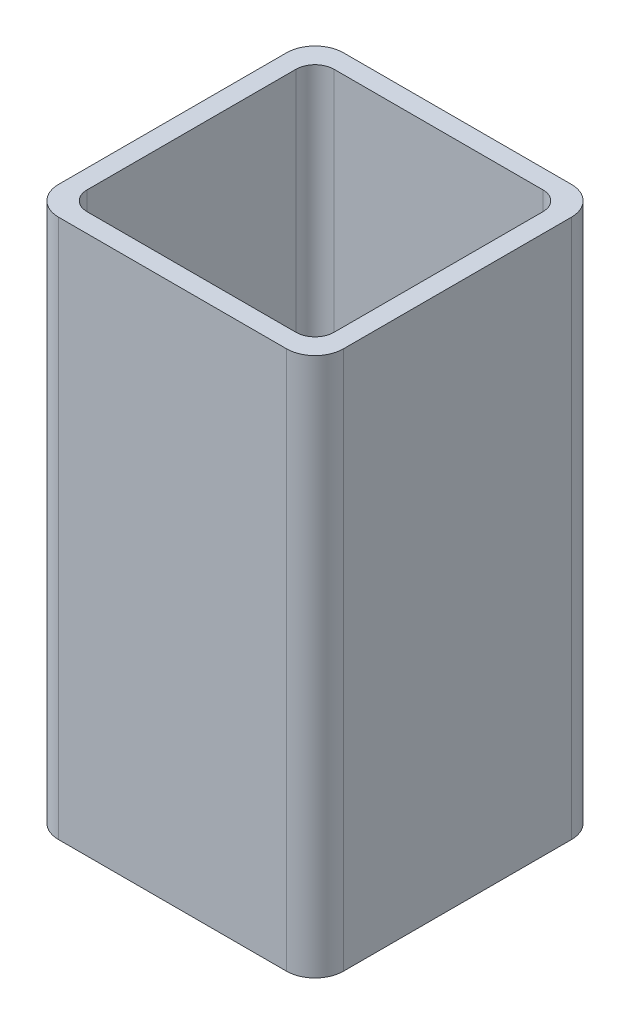
ISO-10303-21;
HEADER;
FILE_DESCRIPTION(('STEP AP214'),'2;1');
FILE_NAME('part.step','',(''),(''),'','','');
FILE_SCHEMA(('AUTOMOTIVE_DESIGN { 1 0 10303 214 1 1 1 1 }'));
ENDSEC;
DATA;
#1=APPLICATION_CONTEXT('core data for automotive mechanical design processes');
#2=APPLICATION_PROTOCOL_DEFINITION('international standard','automotive_design',2000,#1);
#3=PRODUCT_CONTEXT('',#1,'mechanical');
#4=PRODUCT('Part','Part','',(#3));
#5=PRODUCT_RELATED_PRODUCT_CATEGORY('part','',(#4));
#6=PRODUCT_DEFINITION_FORMATION('','',#4);
#7=PRODUCT_DEFINITION_CONTEXT('part definition',#1,'design');
#8=PRODUCT_DEFINITION('design','',#6,#7);
#9=PRODUCT_DEFINITION_SHAPE('','',#8);
#10=(LENGTH_UNIT() NAMED_UNIT(*) SI_UNIT(.MILLI.,.METRE.));
#11=(NAMED_UNIT(*) PLANE_ANGLE_UNIT() SI_UNIT($,.RADIAN.));
#12=(NAMED_UNIT(*) SI_UNIT($,.STERADIAN.) SOLID_ANGLE_UNIT());
#13=UNCERTAINTY_MEASURE_WITH_UNIT(LENGTH_MEASURE(1.E-05),#10,'distance_accuracy_value','');
#14=(GEOMETRIC_REPRESENTATION_CONTEXT(3) GLOBAL_UNCERTAINTY_ASSIGNED_CONTEXT((#13)) GLOBAL_UNIT_ASSIGNED_CONTEXT((#10,
#11,#12)) REPRESENTATION_CONTEXT('',''));
#15=CARTESIAN_POINT('',(0.,0.,0.));
#16=DIRECTION('',(0.,0.,1.));
#17=DIRECTION('',(1.,0.,0.));
#18=AXIS2_PLACEMENT_3D('',#15,#16,#17);
#19=CARTESIAN_POINT('',(-27.,-99.2002175516719,12.));
#20=DIRECTION('',(0.,1.,0.));
#21=DIRECTION('',(0.,0.,1.));
#22=AXIS2_PLACEMENT_3D('',#19,#20,#21);
#23=CYLINDRICAL_SURFACE('',#22,3.);
#24=DIRECTION('',(0.,1.,0.));
#25=VECTOR('',#24,1.);
#26=CARTESIAN_POINT('',(-30.,-99.2002175516719,12.));
#27=LINE('',#26,#25);
#28=CARTESIAN_POINT('',(-30.,-56.773810680479,12.));
#29=VERTEX_POINT('',#28);
#30=CARTESIAN_POINT('',(-30.,0.,12.));
#31=VERTEX_POINT('',#30);
#32=EDGE_CURVE('E189',#29,#31,#27,.T.);
#33=ORIENTED_EDGE('',*,*,#32,.F.);
#34=CARTESIAN_POINT('',(-27.,-56.773810680479,12.));
#35=DIRECTION('',(0.,-1.,0.));
#36=DIRECTION('',(0.,0.,-1.));
#37=AXIS2_PLACEMENT_3D('',#34,#35,#36);
#38=CIRCLE('',#37,3.);
#39=CARTESIAN_POINT('',(-27.,-56.773810680479,15.));
#40=VERTEX_POINT('',#39);
#41=EDGE_CURVE('E183',#29,#40,#38,.F.);
#42=ORIENTED_EDGE('',*,*,#41,.T.);
#43=DIRECTION('',(0.,1.,0.));
#44=VECTOR('',#43,1.);
#45=CARTESIAN_POINT('',(-27.,-99.2002175516719,15.));
#46=LINE('',#45,#44);
#47=CARTESIAN_POINT('',(-27.,0.,15.));
#48=VERTEX_POINT('',#47);
#49=EDGE_CURVE('E185',#40,#48,#46,.T.);
#50=ORIENTED_EDGE('',*,*,#49,.T.);
#51=CARTESIAN_POINT('',(-27.,0.,12.));
#52=DIRECTION('',(0.,1.,0.));
#53=DIRECTION('',(0.,0.,1.));
#54=AXIS2_PLACEMENT_3D('',#51,#52,#53);
#55=CIRCLE('',#54,3.);
#56=EDGE_CURVE('E247',#31,#48,#55,.T.);
#57=ORIENTED_EDGE('',*,*,#56,.F.);
#58=EDGE_LOOP('',(#33,#42,#50,#57));
#59=FACE_BOUND('',#58,.T.);
#60=ADVANCED_FACE('F35',(#59),#23,.T.);
#61=CARTESIAN_POINT('',(-30.,-99.2002175516719,-12.));
#62=DIRECTION('',(-1.,0.,0.));
#63=DIRECTION('',(0.,0.,1.));
#64=AXIS2_PLACEMENT_3D('',#61,#62,#63);
#65=PLANE('',#64);
#66=DIRECTION('',(0.,1.,0.));
#67=VECTOR('',#66,1.);
#68=CARTESIAN_POINT('',(-30.,-99.2002175516719,-12.));
#69=LINE('',#68,#67);
#70=CARTESIAN_POINT('',(-30.,-56.773810680479,-12.));
#71=VERTEX_POINT('',#70);
#72=CARTESIAN_POINT('',(-30.,0.,-12.));
#73=VERTEX_POINT('',#72);
#74=EDGE_CURVE('E193',#71,#73,#69,.T.);
#75=ORIENTED_EDGE('',*,*,#74,.F.);
#76=DIRECTION('',(0.,0.,1.));
#77=VECTOR('',#76,1.);
#78=CARTESIAN_POINT('',(-30.,-56.773810680479,-12.));
#79=LINE('',#78,#77);
#80=EDGE_CURVE('E186',#71,#29,#79,.T.);
#81=ORIENTED_EDGE('',*,*,#80,.T.);
#82=ORIENTED_EDGE('',*,*,#32,.T.);
#83=DIRECTION('',(0.,0.,1.));
#84=VECTOR('',#83,1.);
#85=CARTESIAN_POINT('',(-30.,0.,-12.));
#86=LINE('',#85,#84);
#87=EDGE_CURVE('E169',#73,#31,#86,.T.);
#88=ORIENTED_EDGE('',*,*,#87,.F.);
#89=EDGE_LOOP('',(#75,#81,#82,#88));
#90=FACE_BOUND('',#89,.T.);
#91=ADVANCED_FACE('F291',(#90),#65,.T.);
#92=CARTESIAN_POINT('',(-27.,-99.2002175516719,-12.));
#93=DIRECTION('',(0.,1.,0.));
#94=DIRECTION('',(0.,0.,1.));
#95=AXIS2_PLACEMENT_3D('',#92,#93,#94);
#96=CYLINDRICAL_SURFACE('',#95,3.);
#97=DIRECTION('',(0.,1.,0.));
#98=VECTOR('',#97,1.);
#99=CARTESIAN_POINT('',(-27.,-99.2002175516719,-15.));
#100=LINE('',#99,#98);
#101=CARTESIAN_POINT('',(-27.,-56.773810680479,-15.));
#102=VERTEX_POINT('',#101);
#103=CARTESIAN_POINT('',(-27.,0.,-15.));
#104=VERTEX_POINT('',#103);
#105=EDGE_CURVE('E197',#102,#104,#100,.T.);
#106=ORIENTED_EDGE('',*,*,#105,.F.);
#107=CARTESIAN_POINT('',(-27.,-56.773810680479,-12.));
#108=DIRECTION('',(0.,-1.,0.));
#109=DIRECTION('',(0.,0.,-1.));
#110=AXIS2_PLACEMENT_3D('',#107,#108,#109);
#111=CIRCLE('',#110,3.);
#112=EDGE_CURVE('E190',#102,#71,#111,.F.);
#113=ORIENTED_EDGE('',*,*,#112,.T.);
#114=ORIENTED_EDGE('',*,*,#74,.T.);
#115=CARTESIAN_POINT('',(-27.,0.,-12.));
#116=DIRECTION('',(0.,1.,0.));
#117=DIRECTION('',(0.,0.,1.));
#118=AXIS2_PLACEMENT_3D('',#115,#116,#117);
#119=CIRCLE('',#118,3.);
#120=EDGE_CURVE('E338',#104,#73,#119,.T.);
#121=ORIENTED_EDGE('',*,*,#120,.F.);
#122=EDGE_LOOP('',(#106,#113,#114,#121));
#123=FACE_BOUND('',#122,.T.);
#124=ADVANCED_FACE('F297',(#123),#96,.T.);
#125=CARTESIAN_POINT('',(-27.,-99.2002175516719,-15.));
#126=DIRECTION('',(0.,0.,-1.));
#127=DIRECTION('',(-1.,0.,0.));
#128=AXIS2_PLACEMENT_3D('',#125,#126,#127);
#129=PLANE('',#128);
#130=DIRECTION('',(0.,1.,0.));
#131=VECTOR('',#130,1.);
#132=CARTESIAN_POINT('',(-3.00000000000004,-99.2002175516719,-15.));
#133=LINE('',#132,#131);
#134=CARTESIAN_POINT('',(-3.00000000000004,-56.773810680479,-15.));
#135=VERTEX_POINT('',#134);
#136=CARTESIAN_POINT('',(-3.00000000000004,0.,-15.));
#137=VERTEX_POINT('',#136);
#138=EDGE_CURVE('E201',#135,#137,#133,.T.);
#139=ORIENTED_EDGE('',*,*,#138,.F.);
#140=DIRECTION('',(-1.,0.,0.));
#141=VECTOR('',#140,1.);
#142=CARTESIAN_POINT('',(-27.,-56.773810680479,-15.));
#143=LINE('',#142,#141);
#144=EDGE_CURVE('E194',#135,#102,#143,.T.);
#145=ORIENTED_EDGE('',*,*,#144,.T.);
#146=ORIENTED_EDGE('',*,*,#105,.T.);
#147=DIRECTION('',(-1.,0.,0.));
#148=VECTOR('',#147,1.);
#149=CARTESIAN_POINT('',(-27.,0.,-15.));
#150=LINE('',#149,#148);
#151=EDGE_CURVE('E346',#137,#104,#150,.T.);
#152=ORIENTED_EDGE('',*,*,#151,.F.);
#153=EDGE_LOOP('',(#139,#145,#146,#152));
#154=FACE_BOUND('',#153,.T.);
#155=ADVANCED_FACE('F327',(#154),#129,.T.);
#156=CARTESIAN_POINT('',(-3.00000000000004,-99.2002175516719,-12.));
#157=DIRECTION('',(0.,1.,0.));
#158=DIRECTION('',(0.,0.,1.));
#159=AXIS2_PLACEMENT_3D('',#156,#157,#158);
#160=CYLINDRICAL_SURFACE('',#159,3.);
#161=DIRECTION('',(0.,1.,0.));
#162=VECTOR('',#161,1.);
#163=CARTESIAN_POINT('',(0.,-99.2002175516719,-12.));
#164=LINE('',#163,#162);
#165=CARTESIAN_POINT('',(0.,-56.773810680479,-12.));
#166=VERTEX_POINT('',#165);
#167=CARTESIAN_POINT('',(0.,0.,-12.));
#168=VERTEX_POINT('',#167);
#169=EDGE_CURVE('E205',#166,#168,#164,.T.);
#170=ORIENTED_EDGE('',*,*,#169,.F.);
#171=CARTESIAN_POINT('',(-3.00000000000004,-56.773810680479,-12.));
#172=DIRECTION('',(0.,-1.,0.));
#173=DIRECTION('',(0.,0.,-1.));
#174=AXIS2_PLACEMENT_3D('',#171,#172,#173);
#175=CIRCLE('',#174,3.);
#176=EDGE_CURVE('E198',#166,#135,#175,.F.);
#177=ORIENTED_EDGE('',*,*,#176,.T.);
#178=ORIENTED_EDGE('',*,*,#138,.T.);
#179=CARTESIAN_POINT('',(-3.00000000000004,0.,-12.));
#180=DIRECTION('',(0.,1.,0.));
#181=DIRECTION('',(0.,0.,-1.));
#182=AXIS2_PLACEMENT_3D('',#179,#180,#181);
#183=CIRCLE('',#182,3.);
#184=EDGE_CURVE('E349',#168,#137,#183,.T.);
#185=ORIENTED_EDGE('',*,*,#184,.F.);
#186=EDGE_LOOP('',(#170,#177,#178,#185));
#187=FACE_BOUND('',#186,.T.);
#188=ADVANCED_FACE('F323',(#187),#160,.T.);
#189=CARTESIAN_POINT('',(0.,-99.2002175516719,-12.));
#190=DIRECTION('',(1.,0.,0.));
#191=DIRECTION('',(0.,0.,-1.));
#192=AXIS2_PLACEMENT_3D('',#189,#190,#191);
#193=PLANE('',#192);
#194=DIRECTION('',(0.,1.,0.));
#195=VECTOR('',#194,1.);
#196=CARTESIAN_POINT('',(0.,-99.2002175516719,12.));
#197=LINE('',#196,#195);
#198=CARTESIAN_POINT('',(0.,-56.773810680479,12.));
#199=VERTEX_POINT('',#198);
#200=CARTESIAN_POINT('',(0.,0.,12.));
#201=VERTEX_POINT('',#200);
#202=EDGE_CURVE('E208',#199,#201,#197,.T.);
#203=ORIENTED_EDGE('',*,*,#202,.F.);
#204=DIRECTION('',(0.,0.,-1.));
#205=VECTOR('',#204,1.);
#206=CARTESIAN_POINT('',(0.,-56.773810680479,-12.));
#207=LINE('',#206,#205);
#208=EDGE_CURVE('E202',#199,#166,#207,.T.);
#209=ORIENTED_EDGE('',*,*,#208,.T.);
#210=ORIENTED_EDGE('',*,*,#169,.T.);
#211=DIRECTION('',(0.,0.,-1.));
#212=VECTOR('',#211,1.);
#213=CARTESIAN_POINT('',(0.,0.,-12.));
#214=LINE('',#213,#212);
#215=EDGE_CURVE('E353',#201,#168,#214,.T.);
#216=ORIENTED_EDGE('',*,*,#215,.F.);
#217=EDGE_LOOP('',(#203,#209,#210,#216));
#218=FACE_BOUND('',#217,.T.);
#219=ADVANCED_FACE('F319',(#218),#193,.T.);
#220=CARTESIAN_POINT('',(-3.00000000000003,-99.2002175516719,12.));
#221=DIRECTION('',(0.,1.,0.));
#222=DIRECTION('',(0.,0.,1.));
#223=AXIS2_PLACEMENT_3D('',#220,#221,#222);
#224=CYLINDRICAL_SURFACE('',#223,3.);
#225=DIRECTION('',(0.,1.,0.));
#226=VECTOR('',#225,1.);
#227=CARTESIAN_POINT('',(-3.00000000000003,-99.2002175516719,15.));
#228=LINE('',#227,#226);
#229=CARTESIAN_POINT('',(-3.00000000000003,-56.7738106804791,15.));
#230=VERTEX_POINT('',#229);
#231=CARTESIAN_POINT('',(-3.00000000000003,0.,15.));
#232=VERTEX_POINT('',#231);
#233=EDGE_CURVE('E216',#230,#232,#228,.T.);
#234=ORIENTED_EDGE('',*,*,#233,.F.);
#235=CARTESIAN_POINT('',(-3.00000000000003,-56.773810680479,12.));
#236=DIRECTION('',(0.,-1.,0.));
#237=DIRECTION('',(0.,0.,-1.));
#238=AXIS2_PLACEMENT_3D('',#235,#236,#237);
#239=CIRCLE('',#238,3.);
#240=EDGE_CURVE('E206',#230,#199,#239,.F.);
#241=ORIENTED_EDGE('',*,*,#240,.T.);
#242=ORIENTED_EDGE('',*,*,#202,.T.);
#243=CARTESIAN_POINT('',(-3.00000000000003,0.,12.));
#244=DIRECTION('',(0.,1.,0.));
#245=DIRECTION('',(0.,0.,1.));
#246=AXIS2_PLACEMENT_3D('',#243,#244,#245);
#247=CIRCLE('',#246,3.);
#248=EDGE_CURVE('E256',#232,#201,#247,.T.);
#249=ORIENTED_EDGE('',*,*,#248,.F.);
#250=EDGE_LOOP('',(#234,#241,#242,#249));
#251=FACE_BOUND('',#250,.T.);
#252=ADVANCED_FACE('F315',(#251),#224,.T.);
#253=CARTESIAN_POINT('',(-27.,-99.2002175516719,15.));
#254=DIRECTION('',(0.,0.,1.));
#255=DIRECTION('',(1.,0.,0.));
#256=AXIS2_PLACEMENT_3D('',#253,#254,#255);
#257=PLANE('',#256);
#258=ORIENTED_EDGE('',*,*,#49,.F.);
#259=DIRECTION('',(1.,0.,0.));
#260=VECTOR('',#259,1.);
#261=CARTESIAN_POINT('',(-27.,-56.773810680479,15.));
#262=LINE('',#261,#260);
#263=EDGE_CURVE('E53',#40,#230,#262,.T.);
#264=ORIENTED_EDGE('',*,*,#263,.T.);
#265=ORIENTED_EDGE('',*,*,#233,.T.);
#266=DIRECTION('',(1.,0.,0.));
#267=VECTOR('',#266,1.);
#268=CARTESIAN_POINT('',(-27.,0.,15.));
#269=LINE('',#268,#267);
#270=EDGE_CURVE('E250',#48,#232,#269,.T.);
#271=ORIENTED_EDGE('',*,*,#270,.F.);
#272=EDGE_LOOP('',(#258,#264,#265,#271));
#273=FACE_BOUND('',#272,.T.);
#274=ADVANCED_FACE('F312',(#273),#257,.T.);
#275=CARTESIAN_POINT('',(-26.,-99.2002175516719,11.));
#276=DIRECTION('',(0.,1.,0.));
#277=DIRECTION('',(0.,0.,1.));
#278=AXIS2_PLACEMENT_3D('',#275,#276,#277);
#279=CYLINDRICAL_SURFACE('',#278,2.);
#280=CARTESIAN_POINT('',(-26.,-56.773810680479,11.));
#281=DIRECTION('',(0.,-1.,0.));
#282=DIRECTION('',(0.,0.,-1.));
#283=AXIS2_PLACEMENT_3D('',#280,#281,#282);
#284=CIRCLE('',#283,2.);
#285=CARTESIAN_POINT('',(-28.,-56.7738106804791,11.));
#286=VERTEX_POINT('',#285);
#287=CARTESIAN_POINT('',(-26.,-56.7738106804791,13.));
#288=VERTEX_POINT('',#287);
#289=EDGE_CURVE('E147',#286,#288,#284,.F.);
#290=ORIENTED_EDGE('',*,*,#289,.F.);
#291=DIRECTION('',(0.,1.,0.));
#292=VECTOR('',#291,1.);
#293=CARTESIAN_POINT('',(-28.,-99.2002175516719,11.));
#294=LINE('',#293,#292);
#295=CARTESIAN_POINT('',(-28.,0.,11.));
#296=VERTEX_POINT('',#295);
#297=EDGE_CURVE('E218',#286,#296,#294,.T.);
#298=ORIENTED_EDGE('',*,*,#297,.T.);
#299=CARTESIAN_POINT('',(-26.,0.,11.));
#300=DIRECTION('',(0.,1.,0.));
#301=DIRECTION('',(0.,0.,1.));
#302=AXIS2_PLACEMENT_3D('',#299,#300,#301);
#303=CIRCLE('',#302,2.);
#304=CARTESIAN_POINT('',(-26.,0.,13.));
#305=VERTEX_POINT('',#304);
#306=EDGE_CURVE('E150',#296,#305,#303,.T.);
#307=ORIENTED_EDGE('',*,*,#306,.T.);
#308=DIRECTION('',(0.,1.,0.));
#309=VECTOR('',#308,1.);
#310=CARTESIAN_POINT('',(-26.,-99.2002175516719,13.));
#311=LINE('',#310,#309);
#312=EDGE_CURVE('E39',#288,#305,#311,.T.);
#313=ORIENTED_EDGE('',*,*,#312,.F.);
#314=EDGE_LOOP('',(#290,#298,#307,#313));
#315=FACE_BOUND('',#314,.T.);
#316=ADVANCED_FACE('F145',(#315),#279,.F.);
#317=CARTESIAN_POINT('',(-28.,-99.2002175516719,-11.));
#318=DIRECTION('',(-1.,0.,0.));
#319=DIRECTION('',(0.,0.,1.));
#320=AXIS2_PLACEMENT_3D('',#317,#318,#319);
#321=PLANE('',#320);
#322=DIRECTION('',(0.,0.,1.));
#323=VECTOR('',#322,1.);
#324=CARTESIAN_POINT('',(-28.,-56.773810680479,-11.));
#325=LINE('',#324,#323);
#326=CARTESIAN_POINT('',(-28.,-56.7738106804791,-11.));
#327=VERTEX_POINT('',#326);
#328=EDGE_CURVE('E167',#327,#286,#325,.T.);
#329=ORIENTED_EDGE('',*,*,#328,.F.);
#330=DIRECTION('',(0.,1.,0.));
#331=VECTOR('',#330,1.);
#332=CARTESIAN_POINT('',(-28.,-99.2002175516719,-11.));
#333=LINE('',#332,#331);
#334=CARTESIAN_POINT('',(-28.,0.,-11.));
#335=VERTEX_POINT('',#334);
#336=EDGE_CURVE('E221',#327,#335,#333,.T.);
#337=ORIENTED_EDGE('',*,*,#336,.T.);
#338=DIRECTION('',(0.,0.,1.));
#339=VECTOR('',#338,1.);
#340=CARTESIAN_POINT('',(-28.,0.,-11.));
#341=LINE('',#340,#339);
#342=EDGE_CURVE('E223',#335,#296,#341,.T.);
#343=ORIENTED_EDGE('',*,*,#342,.T.);
#344=ORIENTED_EDGE('',*,*,#297,.F.);
#345=EDGE_LOOP('',(#329,#337,#343,#344));
#346=FACE_BOUND('',#345,.T.);
#347=ADVANCED_FACE('F391',(#346),#321,.F.);
#348=CARTESIAN_POINT('',(-26.,-99.2002175516719,-11.));
#349=DIRECTION('',(0.,1.,0.));
#350=DIRECTION('',(0.,0.,1.));
#351=AXIS2_PLACEMENT_3D('',#348,#349,#350);
#352=CYLINDRICAL_SURFACE('',#351,2.);
#353=CARTESIAN_POINT('',(-26.,-56.773810680479,-11.));
#354=DIRECTION('',(0.,-1.,0.));
#355=DIRECTION('',(0.,0.,-1.));
#356=AXIS2_PLACEMENT_3D('',#353,#354,#355);
#357=CIRCLE('',#356,2.);
#358=CARTESIAN_POINT('',(-26.,-56.7738106804791,-13.));
#359=VERTEX_POINT('',#358);
#360=EDGE_CURVE('E11',#359,#327,#357,.F.);
#361=ORIENTED_EDGE('',*,*,#360,.F.);
#362=DIRECTION('',(0.,1.,0.));
#363=VECTOR('',#362,1.);
#364=CARTESIAN_POINT('',(-26.,-99.2002175516719,-13.));
#365=LINE('',#364,#363);
#366=CARTESIAN_POINT('',(-26.,0.,-13.));
#367=VERTEX_POINT('',#366);
#368=EDGE_CURVE('E224',#359,#367,#365,.T.);
#369=ORIENTED_EDGE('',*,*,#368,.T.);
#370=CARTESIAN_POINT('',(-26.,0.,-11.));
#371=DIRECTION('',(0.,1.,0.));
#372=DIRECTION('',(0.,0.,1.));
#373=AXIS2_PLACEMENT_3D('',#370,#371,#372);
#374=CIRCLE('',#373,2.);
#375=EDGE_CURVE('E226',#367,#335,#374,.T.);
#376=ORIENTED_EDGE('',*,*,#375,.T.);
#377=ORIENTED_EDGE('',*,*,#336,.F.);
#378=EDGE_LOOP('',(#361,#369,#376,#377));
#379=FACE_BOUND('',#378,.T.);
#380=ADVANCED_FACE('F276',(#379),#352,.F.);
#381=CARTESIAN_POINT('',(-26.,-99.2002175516719,-13.));
#382=DIRECTION('',(0.,0.,-1.));
#383=DIRECTION('',(-1.,0.,0.));
#384=AXIS2_PLACEMENT_3D('',#381,#382,#383);
#385=PLANE('',#384);
#386=DIRECTION('',(-1.,0.,0.));
#387=VECTOR('',#386,1.);
#388=CARTESIAN_POINT('',(-26.,-56.773810680479,-13.));
#389=LINE('',#388,#387);
#390=CARTESIAN_POINT('',(-4.00000000000005,-56.7738106804791,-13.));
#391=VERTEX_POINT('',#390);
#392=EDGE_CURVE('E45',#391,#359,#389,.T.);
#393=ORIENTED_EDGE('',*,*,#392,.F.);
#394=DIRECTION('',(0.,1.,0.));
#395=VECTOR('',#394,1.);
#396=CARTESIAN_POINT('',(-4.00000000000005,-99.2002175516719,-13.));
#397=LINE('',#396,#395);
#398=CARTESIAN_POINT('',(-4.00000000000005,0.,-13.));
#399=VERTEX_POINT('',#398);
#400=EDGE_CURVE('E227',#391,#399,#397,.T.);
#401=ORIENTED_EDGE('',*,*,#400,.T.);
#402=DIRECTION('',(-1.,0.,0.));
#403=VECTOR('',#402,1.);
#404=CARTESIAN_POINT('',(-26.,0.,-13.));
#405=LINE('',#404,#403);
#406=EDGE_CURVE('E229',#399,#367,#405,.T.);
#407=ORIENTED_EDGE('',*,*,#406,.T.);
#408=ORIENTED_EDGE('',*,*,#368,.F.);
#409=EDGE_LOOP('',(#393,#401,#407,#408));
#410=FACE_BOUND('',#409,.T.);
#411=ADVANCED_FACE('F268',(#410),#385,.F.);
#412=CARTESIAN_POINT('',(-4.00000000000003,-99.2002175516719,-11.));
#413=DIRECTION('',(0.,1.,0.));
#414=DIRECTION('',(0.,0.,1.));
#415=AXIS2_PLACEMENT_3D('',#412,#413,#414);
#416=CYLINDRICAL_SURFACE('',#415,2.);
#417=CARTESIAN_POINT('',(-4.00000000000003,-56.773810680479,-11.));
#418=DIRECTION('',(0.,-1.,0.));
#419=DIRECTION('',(0.,0.,-1.));
#420=AXIS2_PLACEMENT_3D('',#417,#418,#419);
#421=CIRCLE('',#420,2.);
#422=CARTESIAN_POINT('',(-2.00000000000003,-56.7738106804791,-11.));
#423=VERTEX_POINT('',#422);
#424=EDGE_CURVE('E176',#423,#391,#421,.F.);
#425=ORIENTED_EDGE('',*,*,#424,.F.);
#426=DIRECTION('',(0.,1.,0.));
#427=VECTOR('',#426,1.);
#428=CARTESIAN_POINT('',(-2.00000000000003,-99.2002175516719,-11.));
#429=LINE('',#428,#427);
#430=CARTESIAN_POINT('',(-2.00000000000003,0.,-11.));
#431=VERTEX_POINT('',#430);
#432=EDGE_CURVE('E230',#423,#431,#429,.T.);
#433=ORIENTED_EDGE('',*,*,#432,.T.);
#434=CARTESIAN_POINT('',(-4.00000000000003,0.,-11.));
#435=DIRECTION('',(0.,1.,0.));
#436=DIRECTION('',(0.,0.,-1.));
#437=AXIS2_PLACEMENT_3D('',#434,#435,#436);
#438=CIRCLE('',#437,2.);
#439=EDGE_CURVE('E232',#431,#399,#438,.T.);
#440=ORIENTED_EDGE('',*,*,#439,.T.);
#441=ORIENTED_EDGE('',*,*,#400,.F.);
#442=EDGE_LOOP('',(#425,#433,#440,#441));
#443=FACE_BOUND('',#442,.T.);
#444=ADVANCED_FACE('F278',(#443),#416,.F.);
#445=CARTESIAN_POINT('',(-2.00000000000003,-99.2002175516719,-11.));
#446=DIRECTION('',(1.,0.,0.));
#447=DIRECTION('',(0.,0.,-1.));
#448=AXIS2_PLACEMENT_3D('',#445,#446,#447);
#449=PLANE('',#448);
#450=DIRECTION('',(0.,0.,-1.));
#451=VECTOR('',#450,1.);
#452=CARTESIAN_POINT('',(-2.00000000000003,-56.773810680479,-11.));
#453=LINE('',#452,#451);
#454=CARTESIAN_POINT('',(-2.00000000000003,-56.7738106804791,11.));
#455=VERTEX_POINT('',#454);
#456=EDGE_CURVE('E179',#455,#423,#453,.T.);
#457=ORIENTED_EDGE('',*,*,#456,.F.);
#458=DIRECTION('',(0.,1.,0.));
#459=VECTOR('',#458,1.);
#460=CARTESIAN_POINT('',(-2.00000000000003,-99.2002175516719,11.));
#461=LINE('',#460,#459);
#462=CARTESIAN_POINT('',(-2.00000000000003,0.,11.));
#463=VERTEX_POINT('',#462);
#464=EDGE_CURVE('E233',#455,#463,#461,.T.);
#465=ORIENTED_EDGE('',*,*,#464,.T.);
#466=DIRECTION('',(0.,0.,-1.));
#467=VECTOR('',#466,1.);
#468=CARTESIAN_POINT('',(-2.00000000000003,0.,-11.));
#469=LINE('',#468,#467);
#470=EDGE_CURVE('E234',#463,#431,#469,.T.);
#471=ORIENTED_EDGE('',*,*,#470,.T.);
#472=ORIENTED_EDGE('',*,*,#432,.F.);
#473=EDGE_LOOP('',(#457,#465,#471,#472));
#474=FACE_BOUND('',#473,.T.);
#475=ADVANCED_FACE('F281',(#474),#449,.F.);
#476=CARTESIAN_POINT('',(-4.00000000000003,-99.2002175516719,11.));
#477=DIRECTION('',(0.,1.,0.));
#478=DIRECTION('',(0.,0.,1.));
#479=AXIS2_PLACEMENT_3D('',#476,#477,#478);
#480=CYLINDRICAL_SURFACE('',#479,2.);
#481=CARTESIAN_POINT('',(-4.00000000000003,-56.773810680479,11.));
#482=DIRECTION('',(0.,-1.,0.));
#483=DIRECTION('',(0.,0.,-1.));
#484=AXIS2_PLACEMENT_3D('',#481,#482,#483);
#485=CIRCLE('',#484,2.);
#486=CARTESIAN_POINT('',(-4.00000000000005,-56.773810680479,13.));
#487=VERTEX_POINT('',#486);
#488=EDGE_CURVE('E164',#487,#455,#485,.F.);
#489=ORIENTED_EDGE('',*,*,#488,.F.);
#490=DIRECTION('',(0.,1.,0.));
#491=VECTOR('',#490,1.);
#492=CARTESIAN_POINT('',(-4.00000000000005,-99.2002175516719,13.));
#493=LINE('',#492,#491);
#494=CARTESIAN_POINT('',(-4.00000000000005,0.,13.));
#495=VERTEX_POINT('',#494);
#496=EDGE_CURVE('E160',#487,#495,#493,.T.);
#497=ORIENTED_EDGE('',*,*,#496,.T.);
#498=CARTESIAN_POINT('',(-4.00000000000003,0.,11.));
#499=DIRECTION('',(0.,1.,0.));
#500=DIRECTION('',(0.,0.,1.));
#501=AXIS2_PLACEMENT_3D('',#498,#499,#500);
#502=CIRCLE('',#501,2.);
#503=EDGE_CURVE('E155',#495,#463,#502,.T.);
#504=ORIENTED_EDGE('',*,*,#503,.T.);
#505=ORIENTED_EDGE('',*,*,#464,.F.);
#506=EDGE_LOOP('',(#489,#497,#504,#505));
#507=FACE_BOUND('',#506,.T.);
#508=ADVANCED_FACE('F280',(#507),#480,.F.);
#509=CARTESIAN_POINT('',(-26.,-99.2002175516719,13.));
#510=DIRECTION('',(0.,0.,1.));
#511=DIRECTION('',(1.,0.,0.));
#512=AXIS2_PLACEMENT_3D('',#509,#510,#511);
#513=PLANE('',#512);
#514=DIRECTION('',(1.,0.,0.));
#515=VECTOR('',#514,1.);
#516=CARTESIAN_POINT('',(-26.,-56.773810680479,13.));
#517=LINE('',#516,#515);
#518=EDGE_CURVE('E158',#288,#487,#517,.T.);
#519=ORIENTED_EDGE('',*,*,#518,.F.);
#520=ORIENTED_EDGE('',*,*,#312,.T.);
#521=DIRECTION('',(1.,0.,0.));
#522=VECTOR('',#521,1.);
#523=CARTESIAN_POINT('',(-26.,0.,13.));
#524=LINE('',#523,#522);
#525=EDGE_CURVE('E154',#305,#495,#524,.T.);
#526=ORIENTED_EDGE('',*,*,#525,.T.);
#527=ORIENTED_EDGE('',*,*,#496,.F.);
#528=EDGE_LOOP('',(#519,#520,#526,#527));
#529=FACE_BOUND('',#528,.T.);
#530=ADVANCED_FACE('F159',(#529),#513,.F.);
#531=CARTESIAN_POINT('',(-27.,0.,12.));
#532=DIRECTION('',(0.,1.,0.));
#533=DIRECTION('',(0.,0.,1.));
#534=AXIS2_PLACEMENT_3D('',#531,#532,#533);
#535=PLANE('',#534);
#536=ORIENTED_EDGE('',*,*,#306,.F.);
#537=ORIENTED_EDGE('',*,*,#342,.F.);
#538=ORIENTED_EDGE('',*,*,#375,.F.);
#539=ORIENTED_EDGE('',*,*,#406,.F.);
#540=ORIENTED_EDGE('',*,*,#439,.F.);
#541=ORIENTED_EDGE('',*,*,#470,.F.);
#542=ORIENTED_EDGE('',*,*,#503,.F.);
#543=ORIENTED_EDGE('',*,*,#525,.F.);
#544=EDGE_LOOP('',(#536,#537,#538,#539,#540,#541,#542,#543));
#545=FACE_BOUND('',#544,.T.);
#546=ORIENTED_EDGE('',*,*,#56,.T.);
#547=ORIENTED_EDGE('',*,*,#270,.T.);
#548=ORIENTED_EDGE('',*,*,#248,.T.);
#549=ORIENTED_EDGE('',*,*,#215,.T.);
#550=ORIENTED_EDGE('',*,*,#184,.T.);
#551=ORIENTED_EDGE('',*,*,#151,.T.);
#552=ORIENTED_EDGE('',*,*,#120,.T.);
#553=ORIENTED_EDGE('',*,*,#87,.T.);
#554=EDGE_LOOP('',(#546,#547,#548,#549,#550,#551,#552,#553));
#555=FACE_BOUND('',#554,.T.);
#556=ADVANCED_FACE('F273',(#545,#555),#535,.T.);
#557=CARTESIAN_POINT('',(82.4264068711927,-56.773810680479,12.));
#558=DIRECTION('',(0.,-1.,0.));
#559=DIRECTION('',(0.,0.,-1.));
#560=AXIS2_PLACEMENT_3D('',#557,#558,#559);
#561=PLANE('',#560);
#562=ORIENTED_EDGE('',*,*,#41,.F.);
#563=ORIENTED_EDGE('',*,*,#80,.F.);
#564=ORIENTED_EDGE('',*,*,#112,.F.);
#565=ORIENTED_EDGE('',*,*,#144,.F.);
#566=ORIENTED_EDGE('',*,*,#176,.F.);
#567=ORIENTED_EDGE('',*,*,#208,.F.);
#568=ORIENTED_EDGE('',*,*,#240,.F.);
#569=ORIENTED_EDGE('',*,*,#263,.F.);
#570=EDGE_LOOP('',(#562,#563,#564,#565,#566,#567,#568,#569));
#571=FACE_BOUND('',#570,.T.);
#572=ORIENTED_EDGE('',*,*,#328,.T.);
#573=ORIENTED_EDGE('',*,*,#289,.T.);
#574=ORIENTED_EDGE('',*,*,#518,.T.);
#575=ORIENTED_EDGE('',*,*,#488,.T.);
#576=ORIENTED_EDGE('',*,*,#456,.T.);
#577=ORIENTED_EDGE('',*,*,#424,.T.);
#578=ORIENTED_EDGE('',*,*,#392,.T.);
#579=ORIENTED_EDGE('',*,*,#360,.T.);
#580=EDGE_LOOP('',(#572,#573,#574,#575,#576,#577,#578,#579));
#581=FACE_BOUND('',#580,.T.);
#582=ADVANCED_FACE('F37',(#571,#581),#561,.T.);
#583=CLOSED_SHELL('',(#60,#91,#124,#155,#188,#219,#252,#274,#316,#347,#380,#411,#444,#475,#508,
#530,#556,#582));
#584=MANIFOLD_SOLID_BREP('B2',#583);
#585=ADVANCED_BREP_SHAPE_REPRESENTATION('',(#18,#584),#14);
#586=SHAPE_DEFINITION_REPRESENTATION(#9,#585);
ENDSEC;
END-ISO-10303-21;
